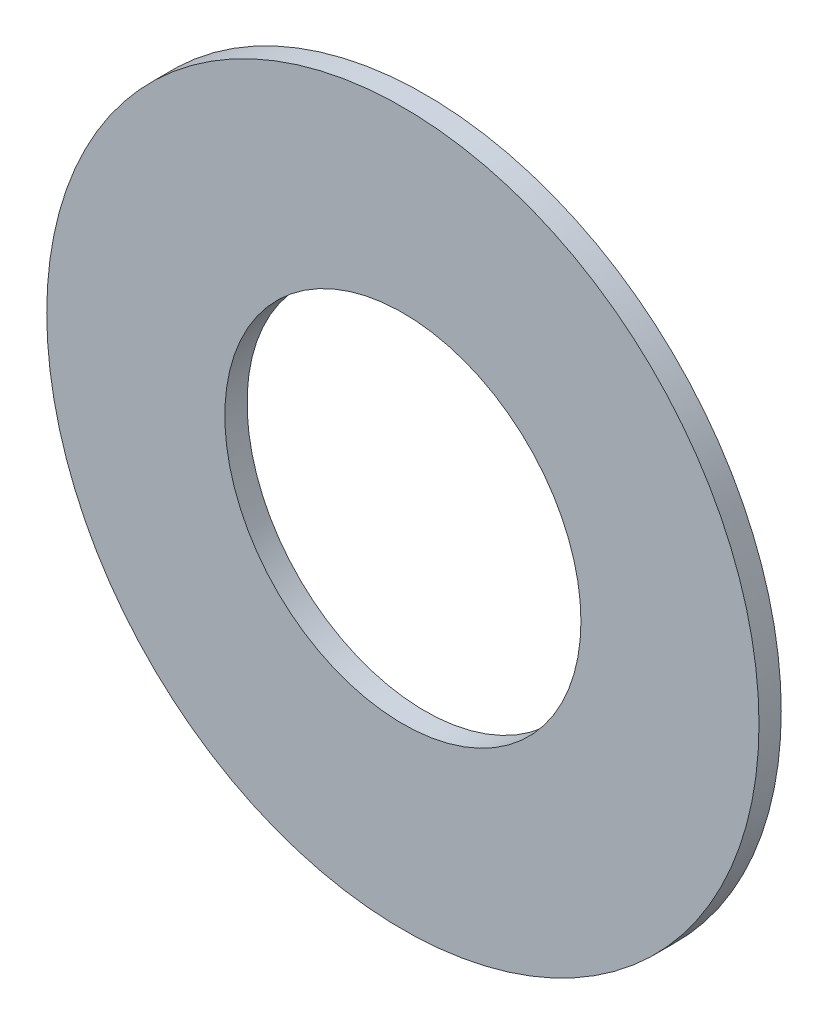
ISO-10303-21;
HEADER;
FILE_DESCRIPTION(('STEP AP214'),'2;1');
FILE_NAME('part.step','',(''),(''),'','','');
FILE_SCHEMA(('AUTOMOTIVE_DESIGN { 1 0 10303 214 1 1 1 1 }'));
ENDSEC;
DATA;
#1=APPLICATION_CONTEXT('core data for automotive mechanical design processes');
#2=APPLICATION_PROTOCOL_DEFINITION('international standard','automotive_design',2000,#1);
#3=PRODUCT_CONTEXT('',#1,'mechanical');
#4=PRODUCT('Part','Part','',(#3));
#5=PRODUCT_RELATED_PRODUCT_CATEGORY('part','',(#4));
#6=PRODUCT_DEFINITION_FORMATION('','',#4);
#7=PRODUCT_DEFINITION_CONTEXT('part definition',#1,'design');
#8=PRODUCT_DEFINITION('design','',#6,#7);
#9=PRODUCT_DEFINITION_SHAPE('','',#8);
#10=(LENGTH_UNIT() NAMED_UNIT(*) SI_UNIT(.MILLI.,.METRE.));
#11=(NAMED_UNIT(*) PLANE_ANGLE_UNIT() SI_UNIT($,.RADIAN.));
#12=(NAMED_UNIT(*) SI_UNIT($,.STERADIAN.) SOLID_ANGLE_UNIT());
#13=UNCERTAINTY_MEASURE_WITH_UNIT(LENGTH_MEASURE(1.E-05),#10,'distance_accuracy_value','');
#14=(GEOMETRIC_REPRESENTATION_CONTEXT(3) GLOBAL_UNCERTAINTY_ASSIGNED_CONTEXT((#13)) GLOBAL_UNIT_ASSIGNED_CONTEXT((#10,
#11,#12)) REPRESENTATION_CONTEXT('',''));
#15=CARTESIAN_POINT('',(0.,0.,0.));
#16=DIRECTION('',(0.,0.,1.));
#17=DIRECTION('',(1.,0.,0.));
#18=AXIS2_PLACEMENT_3D('',#15,#16,#17);
#19=CARTESIAN_POINT('',(0.,0.,0.5));
#20=DIRECTION('',(0.,0.,1.));
#21=DIRECTION('',(1.,0.,0.));
#22=AXIS2_PLACEMENT_3D('',#19,#20,#21);
#23=PLANE('',#22);
#24=CARTESIAN_POINT('',(0.,0.,0.5));
#25=DIRECTION('',(0.,0.,1.));
#26=DIRECTION('',(1.,0.,0.));
#27=AXIS2_PLACEMENT_3D('',#24,#25,#26);
#28=CIRCLE('',#27,8.);
#29=CARTESIAN_POINT('',(8.,0.,0.5));
#30=VERTEX_POINT('',#29);
#31=EDGE_CURVE('E10',#30,#30,#28,.T.);
#32=ORIENTED_EDGE('',*,*,#31,.T.);
#33=EDGE_LOOP('',(#32));
#34=FACE_BOUND('',#33,.T.);
#35=CARTESIAN_POINT('',(0.,0.,0.5));
#36=DIRECTION('',(0.,0.,1.));
#37=DIRECTION('',(1.,0.,0.));
#38=AXIS2_PLACEMENT_3D('',#35,#36,#37);
#39=CIRCLE('',#38,4.);
#40=CARTESIAN_POINT('',(4.,0.,0.5));
#41=VERTEX_POINT('',#40);
#42=EDGE_CURVE('E45',#41,#41,#39,.T.);
#43=ORIENTED_EDGE('',*,*,#42,.F.);
#44=EDGE_LOOP('',(#43));
#45=FACE_BOUND('',#44,.T.);
#46=ADVANCED_FACE('F34',(#34,#45),#23,.T.);
#47=CARTESIAN_POINT('',(0.,0.,0.));
#48=DIRECTION('',(0.,0.,1.));
#49=DIRECTION('',(1.,0.,0.));
#50=AXIS2_PLACEMENT_3D('',#47,#48,#49);
#51=PLANE('',#50);
#52=CARTESIAN_POINT('',(0.,0.,0.));
#53=DIRECTION('',(0.,0.,1.));
#54=DIRECTION('',(1.,0.,0.));
#55=AXIS2_PLACEMENT_3D('',#52,#53,#54);
#56=CIRCLE('',#55,8.);
#57=CARTESIAN_POINT('',(8.,0.,0.));
#58=VERTEX_POINT('',#57);
#59=EDGE_CURVE('E38',#58,#58,#56,.T.);
#60=ORIENTED_EDGE('',*,*,#59,.F.);
#61=EDGE_LOOP('',(#60));
#62=FACE_BOUND('',#61,.T.);
#63=CARTESIAN_POINT('',(0.,0.,0.));
#64=DIRECTION('',(0.,0.,1.));
#65=DIRECTION('',(1.,0.,0.));
#66=AXIS2_PLACEMENT_3D('',#63,#64,#65);
#67=CIRCLE('',#66,4.);
#68=CARTESIAN_POINT('',(4.,0.,0.));
#69=VERTEX_POINT('',#68);
#70=EDGE_CURVE('E47',#69,#69,#67,.T.);
#71=ORIENTED_EDGE('',*,*,#70,.T.);
#72=EDGE_LOOP('',(#71));
#73=FACE_BOUND('',#72,.T.);
#74=ADVANCED_FACE('F57',(#62,#73),#51,.F.);
#75=CARTESIAN_POINT('',(0.,0.,0.5));
#76=DIRECTION('',(0.,0.,-1.));
#77=DIRECTION('',(-1.,0.,0.));
#78=AXIS2_PLACEMENT_3D('',#75,#76,#77);
#79=CYLINDRICAL_SURFACE('',#78,8.);
#80=ORIENTED_EDGE('',*,*,#31,.F.);
#81=EDGE_LOOP('',(#80));
#82=FACE_BOUND('',#81,.T.);
#83=ORIENTED_EDGE('',*,*,#59,.T.);
#84=EDGE_LOOP('',(#83));
#85=FACE_BOUND('',#84,.T.);
#86=ADVANCED_FACE('F36',(#82,#85),#79,.T.);
#87=CARTESIAN_POINT('',(0.,0.,0.5));
#88=DIRECTION('',(0.,0.,-1.));
#89=DIRECTION('',(-1.,0.,0.));
#90=AXIS2_PLACEMENT_3D('',#87,#88,#89);
#91=CYLINDRICAL_SURFACE('',#90,4.);
#92=ORIENTED_EDGE('',*,*,#42,.T.);
#93=EDGE_LOOP('',(#92));
#94=FACE_BOUND('',#93,.T.);
#95=ORIENTED_EDGE('',*,*,#70,.F.);
#96=EDGE_LOOP('',(#95));
#97=FACE_BOUND('',#96,.T.);
#98=ADVANCED_FACE('F53',(#94,#97),#91,.F.);
#99=CLOSED_SHELL('',(#46,#74,#86,#98));
#100=MANIFOLD_SOLID_BREP('B2',#99);
#101=ADVANCED_BREP_SHAPE_REPRESENTATION('',(#18,#100),#14);
#102=SHAPE_DEFINITION_REPRESENTATION(#9,#101);
ENDSEC;
END-ISO-10303-21;
